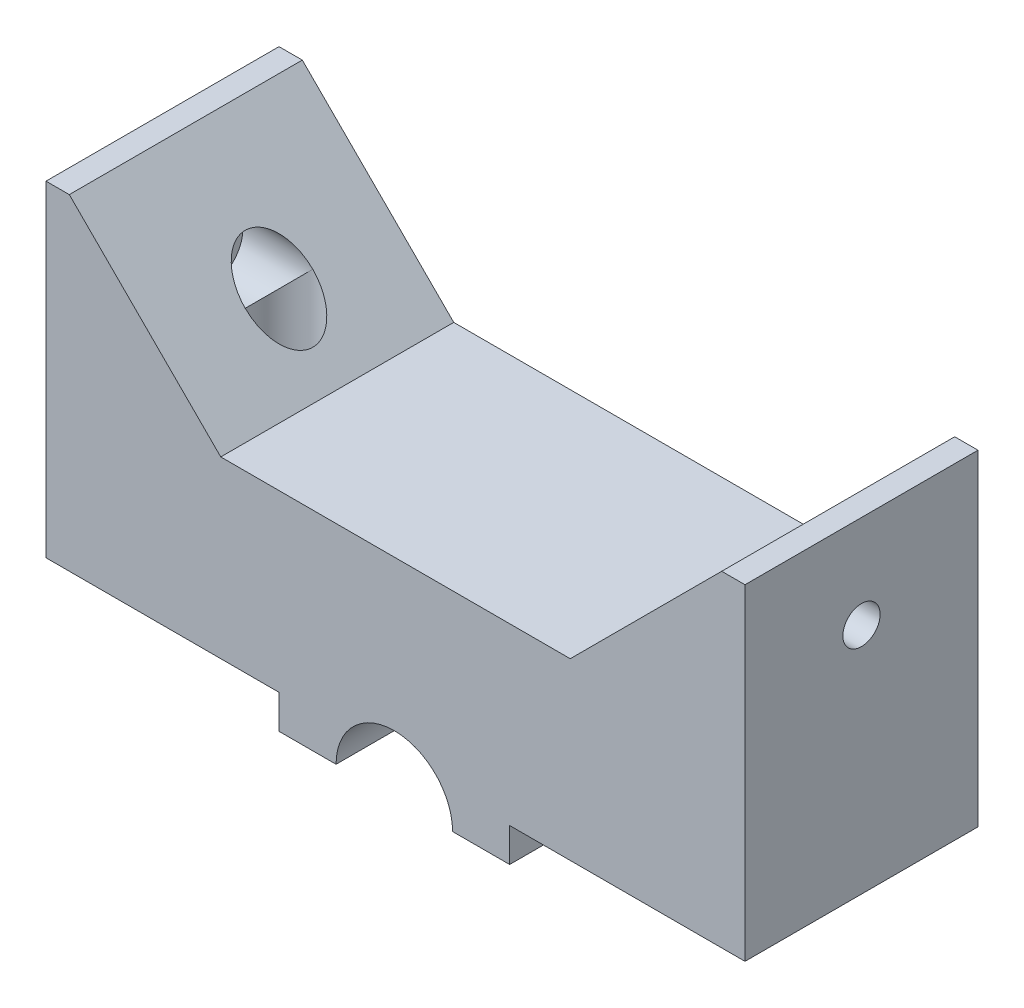
ISO-10303-21;
HEADER;
FILE_DESCRIPTION(('STEP AP214'),'2;1');
FILE_NAME('part.step','',(''),(''),'','','');
FILE_SCHEMA(('AUTOMOTIVE_DESIGN { 1 0 10303 214 1 1 1 1 }'));
ENDSEC;
DATA;
#1=APPLICATION_CONTEXT('core data for automotive mechanical design processes');
#2=APPLICATION_PROTOCOL_DEFINITION('international standard','automotive_design',2000,#1);
#3=PRODUCT_CONTEXT('',#1,'mechanical');
#4=PRODUCT('Part','Part','',(#3));
#5=PRODUCT_RELATED_PRODUCT_CATEGORY('part','',(#4));
#6=PRODUCT_DEFINITION_FORMATION('','',#4);
#7=PRODUCT_DEFINITION_CONTEXT('part definition',#1,'design');
#8=PRODUCT_DEFINITION('design','',#6,#7);
#9=PRODUCT_DEFINITION_SHAPE('','',#8);
#10=(LENGTH_UNIT() NAMED_UNIT(*) SI_UNIT(.MILLI.,.METRE.));
#11=(NAMED_UNIT(*) PLANE_ANGLE_UNIT() SI_UNIT($,.RADIAN.));
#12=(NAMED_UNIT(*) SI_UNIT($,.STERADIAN.) SOLID_ANGLE_UNIT());
#13=UNCERTAINTY_MEASURE_WITH_UNIT(LENGTH_MEASURE(1.E-05),#10,'distance_accuracy_value','');
#14=(GEOMETRIC_REPRESENTATION_CONTEXT(3) GLOBAL_UNCERTAINTY_ASSIGNED_CONTEXT((#13)) GLOBAL_UNIT_ASSIGNED_CONTEXT((#10,
#11,#12)) REPRESENTATION_CONTEXT('',''));
#15=CARTESIAN_POINT('',(0.,0.,0.));
#16=DIRECTION('',(0.,0.,1.));
#17=DIRECTION('',(1.,0.,0.));
#18=AXIS2_PLACEMENT_3D('',#15,#16,#17);
#19=CARTESIAN_POINT('',(4.,20.,10.));
#20=DIRECTION('',(1.,0.,0.));
#21=DIRECTION('',(0.,0.,-1.));
#22=AXIS2_PLACEMENT_3D('',#19,#20,#21);
#23=CYLINDRICAL_SURFACE('',#22,2.9);
#24=CARTESIAN_POINT('',(56.,20.,10.));
#25=DIRECTION('',(-1.,0.,0.));
#26=DIRECTION('',(0.,0.,1.));
#27=AXIS2_PLACEMENT_3D('',#24,#25,#26);
#28=CIRCLE('',#27,2.9);
#29=CARTESIAN_POINT('',(56.,20.,12.9));
#30=VERTEX_POINT('',#29);
#31=EDGE_CURVE('E284',#30,#30,#28,.T.);
#32=ORIENTED_EDGE('',*,*,#31,.F.);
#33=EDGE_LOOP('',(#32));
#34=FACE_BOUND('',#33,.T.);
#35=CARTESIAN_POINT('',(50.,20.,10.));
#36=DIRECTION('',(-0.707106781186548,0.707106781186548,0.));
#37=DIRECTION('',(0.707106781186548,0.707106781186548,0.));
#38=AXIS2_PLACEMENT_3D('',#35,#36,#37);
#39=ELLIPSE('',#38,4.10121933088198,2.9);
#40=CARTESIAN_POINT('',(49.95,19.95,7.1004310665204));
#41=VERTEX_POINT('',#40);
#42=CARTESIAN_POINT('',(49.95,19.95,12.8995689334796));
#43=VERTEX_POINT('',#42);
#44=EDGE_CURVE('E161',#41,#43,#39,.F.);
#45=ORIENTED_EDGE('',*,*,#44,.F.);
#46=CARTESIAN_POINT('',(49.9,20.,10.));
#47=DIRECTION('',(0.707106781186547,0.707106781186548,0.));
#48=DIRECTION('',(0.707106781186547,-0.707106781186548,0.));
#49=AXIS2_PLACEMENT_3D('',#46,#47,#48);
#50=ELLIPSE('',#49,4.10121933088198,2.9);
#51=EDGE_CURVE('E11',#41,#43,#50,.F.);
#52=ORIENTED_EDGE('',*,*,#51,.T.);
#53=EDGE_LOOP('',(#45,#52));
#54=FACE_BOUND('',#53,.T.);
#55=ADVANCED_FACE('F41',(#34,#54),#23,.F.);
#56=CARTESIAN_POINT('',(4.,20.,10.));
#57=DIRECTION('',(-1.,0.,0.));
#58=DIRECTION('',(0.,0.,1.));
#59=AXIS2_PLACEMENT_3D('',#56,#57,#58);
#60=CIRCLE('',#59,2.9);
#61=CARTESIAN_POINT('',(4.,20.,12.9));
#62=VERTEX_POINT('',#61);
#63=EDGE_CURVE('E155',#62,#62,#60,.T.);
#64=ORIENTED_EDGE('',*,*,#63,.T.);
#65=EDGE_LOOP('',(#64));
#66=FACE_BOUND('',#65,.T.);
#67=CARTESIAN_POINT('',(10.,20.,10.));
#68=DIRECTION('',(0.707106781186548,0.707106781186548,0.));
#69=DIRECTION('',(0.707106781186548,-0.707106781186548,0.));
#70=AXIS2_PLACEMENT_3D('',#67,#68,#69);
#71=ELLIPSE('',#70,4.10121933088198,2.9);
#72=CARTESIAN_POINT('',(10.,20.,12.9));
#73=VERTEX_POINT('',#72);
#74=CARTESIAN_POINT('',(10.,20.,7.1));
#75=VERTEX_POINT('',#74);
#76=EDGE_CURVE('E154',#73,#75,#71,.F.);
#77=ORIENTED_EDGE('',*,*,#76,.F.);
#78=CARTESIAN_POINT('',(10.,20.,10.));
#79=DIRECTION('',(0.707106781186547,-0.707106781186548,0.));
#80=DIRECTION('',(0.707106781186547,0.707106781186548,0.));
#81=AXIS2_PLACEMENT_3D('',#78,#79,#80);
#82=ELLIPSE('',#81,4.10121933088198,2.9);
#83=EDGE_CURVE('E49',#73,#75,#82,.T.);
#84=ORIENTED_EDGE('',*,*,#83,.T.);
#85=EDGE_LOOP('',(#77,#84));
#86=FACE_BOUND('',#85,.T.);
#87=ADVANCED_FACE('F158',(#66,#86),#23,.F.);
#88=CARTESIAN_POINT('',(10.,25.,10.));
#89=DIRECTION('',(0.,-1.,0.));
#90=DIRECTION('',(0.,0.,-1.));
#91=AXIS2_PLACEMENT_3D('',#88,#89,#90);
#92=CYLINDRICAL_SURFACE('',#91,1.6);
#93=CARTESIAN_POINT('',(10.,0.,10.));
#94=DIRECTION('',(0.,-1.,0.));
#95=DIRECTION('',(0.,0.,-1.));
#96=AXIS2_PLACEMENT_3D('',#93,#94,#95);
#97=CIRCLE('',#96,1.6);
#98=CARTESIAN_POINT('',(10.,0.,8.4));
#99=VERTEX_POINT('',#98);
#100=EDGE_CURVE('E290',#99,#99,#97,.T.);
#101=ORIENTED_EDGE('',*,*,#100,.T.);
#102=EDGE_LOOP('',(#101));
#103=FACE_BOUND('',#102,.T.);
#104=CARTESIAN_POINT('',(10.,5.,10.));
#105=DIRECTION('',(0.,1.,0.));
#106=DIRECTION('',(0.,0.,1.));
#107=AXIS2_PLACEMENT_3D('',#104,#105,#106);
#108=CIRCLE('',#107,1.6);
#109=CARTESIAN_POINT('',(10.,5.,11.6));
#110=VERTEX_POINT('',#109);
#111=EDGE_CURVE('E302',#110,#110,#108,.T.);
#112=ORIENTED_EDGE('',*,*,#111,.T.);
#113=EDGE_LOOP('',(#112));
#114=FACE_BOUND('',#113,.T.);
#115=ADVANCED_FACE('F337',(#103,#114),#92,.F.);
#116=CARTESIAN_POINT('',(49.9,25.,10.));
#117=DIRECTION('',(0.,-1.,0.));
#118=DIRECTION('',(0.,0.,-1.));
#119=AXIS2_PLACEMENT_3D('',#116,#117,#118);
#120=CYLINDRICAL_SURFACE('',#119,1.6);
#121=CARTESIAN_POINT('',(49.9,0.,10.));
#122=DIRECTION('',(0.,-1.,0.));
#123=DIRECTION('',(0.,0.,-1.));
#124=AXIS2_PLACEMENT_3D('',#121,#122,#123);
#125=CIRCLE('',#124,1.6);
#126=CARTESIAN_POINT('',(49.9,0.,8.4));
#127=VERTEX_POINT('',#126);
#128=EDGE_CURVE('E291',#127,#127,#125,.T.);
#129=ORIENTED_EDGE('',*,*,#128,.T.);
#130=EDGE_LOOP('',(#129));
#131=FACE_BOUND('',#130,.T.);
#132=CARTESIAN_POINT('',(49.9,5.,10.));
#133=DIRECTION('',(0.,1.,0.));
#134=DIRECTION('',(0.,0.,1.));
#135=AXIS2_PLACEMENT_3D('',#132,#133,#134);
#136=CIRCLE('',#135,1.6);
#137=CARTESIAN_POINT('',(49.9,5.,11.6));
#138=VERTEX_POINT('',#137);
#139=EDGE_CURVE('E301',#138,#138,#136,.T.);
#140=ORIENTED_EDGE('',*,*,#139,.T.);
#141=EDGE_LOOP('',(#140));
#142=FACE_BOUND('',#141,.T.);
#143=ADVANCED_FACE('F310',(#131,#142),#120,.F.);
#144=CARTESIAN_POINT('',(15.,-15.,5.));
#145=DIRECTION('',(-0.707106781186548,0.707106781186548,0.));
#146=DIRECTION('',(-0.707106781186548,-0.707106781186548,0.));
#147=AXIS2_PLACEMENT_3D('',#144,#145,#146);
#148=PLANE('',#147);
#149=DIRECTION('',(0.707106781186548,0.707106781186548,0.));
#150=VECTOR('',#149,1.);
#151=CARTESIAN_POINT('',(15.,-15.,0.));
#152=LINE('',#151,#150);
#153=CARTESIAN_POINT('',(45.,15.,0.));
#154=VERTEX_POINT('',#153);
#155=CARTESIAN_POINT('',(58.,28.,0.));
#156=VERTEX_POINT('',#155);
#157=EDGE_CURVE('E200',#154,#156,#152,.T.);
#158=ORIENTED_EDGE('',*,*,#157,.F.);
#159=DIRECTION('',(0.,0.,-1.));
#160=VECTOR('',#159,1.);
#161=CARTESIAN_POINT('',(45.,15.,5.));
#162=LINE('',#161,#160);
#163=CARTESIAN_POINT('',(45.,15.,20.));
#164=VERTEX_POINT('',#163);
#165=EDGE_CURVE('E187',#164,#154,#162,.T.);
#166=ORIENTED_EDGE('',*,*,#165,.F.);
#167=DIRECTION('',(-0.707106781186548,-0.707106781186548,0.));
#168=VECTOR('',#167,1.);
#169=CARTESIAN_POINT('',(15.,-15.,20.));
#170=LINE('',#169,#168);
#171=CARTESIAN_POINT('',(58.,28.,20.));
#172=VERTEX_POINT('',#171);
#173=EDGE_CURVE('E255',#172,#164,#170,.T.);
#174=ORIENTED_EDGE('',*,*,#173,.F.);
#175=DIRECTION('',(0.,0.,-1.));
#176=VECTOR('',#175,1.);
#177=CARTESIAN_POINT('',(58.,28.,5.));
#178=LINE('',#177,#176);
#179=EDGE_CURVE('E185',#172,#156,#178,.T.);
#180=ORIENTED_EDGE('',*,*,#179,.T.);
#181=EDGE_LOOP('',(#158,#166,#174,#180));
#182=FACE_BOUND('',#181,.T.);
#183=ORIENTED_EDGE('',*,*,#44,.T.);
#184=CARTESIAN_POINT('',(49.9,19.9,10.));
#185=DIRECTION('',(-0.707106781186548,0.707106781186548,0.));
#186=DIRECTION('',(-0.707106781186548,-0.707106781186548,0.));
#187=AXIS2_PLACEMENT_3D('',#184,#185,#186);
#188=ELLIPSE('',#187,4.10121933088198,2.9);
#189=EDGE_CURVE('E55',#43,#41,#188,.F.);
#190=ORIENTED_EDGE('',*,*,#189,.T.);
#191=EDGE_LOOP('',(#183,#190));
#192=FACE_BOUND('',#191,.T.);
#193=ADVANCED_FACE('F366',(#182,#192),#148,.T.);
#194=CARTESIAN_POINT('',(15.,15.,5.));
#195=DIRECTION('',(0.707106781186548,0.707106781186548,0.));
#196=DIRECTION('',(-0.707106781186548,0.707106781186548,0.));
#197=AXIS2_PLACEMENT_3D('',#194,#195,#196);
#198=PLANE('',#197);
#199=DIRECTION('',(0.707106781186548,-0.707106781186548,0.));
#200=VECTOR('',#199,1.);
#201=CARTESIAN_POINT('',(15.,15.,0.));
#202=LINE('',#201,#200);
#203=CARTESIAN_POINT('',(2.,28.,0.));
#204=VERTEX_POINT('',#203);
#205=CARTESIAN_POINT('',(15.,15.,0.));
#206=VERTEX_POINT('',#205);
#207=EDGE_CURVE('E194',#204,#206,#202,.T.);
#208=ORIENTED_EDGE('',*,*,#207,.F.);
#209=DIRECTION('',(0.,0.,-1.));
#210=VECTOR('',#209,1.);
#211=CARTESIAN_POINT('',(2.,28.,5.));
#212=LINE('',#211,#210);
#213=CARTESIAN_POINT('',(1.99999999999999,28.,20.));
#214=VERTEX_POINT('',#213);
#215=EDGE_CURVE('E191',#214,#204,#212,.T.);
#216=ORIENTED_EDGE('',*,*,#215,.F.);
#217=DIRECTION('',(-0.707106781186548,0.707106781186548,0.));
#218=VECTOR('',#217,1.);
#219=CARTESIAN_POINT('',(15.,15.,20.));
#220=LINE('',#219,#218);
#221=CARTESIAN_POINT('',(15.,15.,20.));
#222=VERTEX_POINT('',#221);
#223=EDGE_CURVE('E249',#222,#214,#220,.T.);
#224=ORIENTED_EDGE('',*,*,#223,.F.);
#225=DIRECTION('',(0.,0.,-1.));
#226=VECTOR('',#225,1.);
#227=CARTESIAN_POINT('',(15.,15.,5.));
#228=LINE('',#227,#226);
#229=EDGE_CURVE('E189',#222,#206,#228,.T.);
#230=ORIENTED_EDGE('',*,*,#229,.T.);
#231=EDGE_LOOP('',(#208,#216,#224,#230));
#232=FACE_BOUND('',#231,.T.);
#233=ORIENTED_EDGE('',*,*,#76,.T.);
#234=EDGE_CURVE('E149',#75,#73,#71,.F.);
#235=ORIENTED_EDGE('',*,*,#234,.T.);
#236=EDGE_LOOP('',(#233,#235));
#237=FACE_BOUND('',#236,.T.);
#238=ADVANCED_FACE('F160',(#232,#237),#198,.T.);
#239=CARTESIAN_POINT('',(0.,20.,10.));
#240=DIRECTION('',(1.,0.,0.));
#241=DIRECTION('',(0.,0.,-1.));
#242=AXIS2_PLACEMENT_3D('',#239,#240,#241);
#243=CYLINDRICAL_SURFACE('',#242,1.6);
#244=CARTESIAN_POINT('',(60.,20.,10.));
#245=DIRECTION('',(1.,0.,0.));
#246=DIRECTION('',(0.,0.,-1.));
#247=AXIS2_PLACEMENT_3D('',#244,#245,#246);
#248=CIRCLE('',#247,1.6);
#249=CARTESIAN_POINT('',(60.,20.,8.4));
#250=VERTEX_POINT('',#249);
#251=EDGE_CURVE('E163',#250,#250,#248,.T.);
#252=ORIENTED_EDGE('',*,*,#251,.T.);
#253=EDGE_LOOP('',(#252));
#254=FACE_BOUND('',#253,.T.);
#255=CARTESIAN_POINT('',(56.,20.,10.));
#256=DIRECTION('',(-1.,0.,0.));
#257=DIRECTION('',(0.,0.,1.));
#258=AXIS2_PLACEMENT_3D('',#255,#256,#257);
#259=CIRCLE('',#258,1.6);
#260=CARTESIAN_POINT('',(56.,20.,11.6));
#261=VERTEX_POINT('',#260);
#262=EDGE_CURVE('E287',#261,#261,#259,.T.);
#263=ORIENTED_EDGE('',*,*,#262,.T.);
#264=EDGE_LOOP('',(#263));
#265=FACE_BOUND('',#264,.T.);
#266=ADVANCED_FACE('F348',(#254,#265),#243,.F.);
#267=CARTESIAN_POINT('',(0.,0.,5.));
#268=DIRECTION('',(0.,0.,1.));
#269=DIRECTION('',(1.,0.,0.));
#270=AXIS2_PLACEMENT_3D('',#267,#268,#269);
#271=PLANE('',#270);
#272=DIRECTION('',(1.,0.,0.));
#273=VECTOR('',#272,1.);
#274=CARTESIAN_POINT('',(0.,-2.9,5.));
#275=LINE('',#274,#273);
#276=CARTESIAN_POINT('',(24.9,-2.9,5.));
#277=VERTEX_POINT('',#276);
#278=CARTESIAN_POINT('',(34.9,-2.9,5.));
#279=VERTEX_POINT('',#278);
#280=EDGE_CURVE('E193',#277,#279,#275,.T.);
#281=ORIENTED_EDGE('',*,*,#280,.T.);
#282=CARTESIAN_POINT('',(29.9,-2.9,5.));
#283=DIRECTION('',(0.,0.,1.));
#284=DIRECTION('',(1.,0.,0.));
#285=AXIS2_PLACEMENT_3D('',#282,#283,#284);
#286=CIRCLE('',#285,5.);
#287=EDGE_CURVE('E232',#279,#277,#286,.T.);
#288=ORIENTED_EDGE('',*,*,#287,.T.);
#289=EDGE_LOOP('',(#281,#288));
#290=FACE_BOUND('',#289,.T.);
#291=ADVANCED_FACE('F357',(#290),#271,.T.);
#292=CARTESIAN_POINT('',(0.,28.,5.));
#293=DIRECTION('',(0.,1.,0.));
#294=DIRECTION('',(0.,0.,1.));
#295=AXIS2_PLACEMENT_3D('',#292,#293,#294);
#296=PLANE('',#295);
#297=DIRECTION('',(1.,0.,0.));
#298=VECTOR('',#297,1.);
#299=CARTESIAN_POINT('',(0.,28.,0.));
#300=LINE('',#299,#298);
#301=CARTESIAN_POINT('',(0.,28.,0.));
#302=VERTEX_POINT('',#301);
#303=EDGE_CURVE('E222',#302,#204,#300,.T.);
#304=ORIENTED_EDGE('',*,*,#303,.F.);
#305=DIRECTION('',(0.,0.,-1.));
#306=VECTOR('',#305,1.);
#307=CARTESIAN_POINT('',(0.,28.,5.));
#308=LINE('',#307,#306);
#309=CARTESIAN_POINT('',(0.,28.,20.));
#310=VERTEX_POINT('',#309);
#311=EDGE_CURVE('E159',#310,#302,#308,.T.);
#312=ORIENTED_EDGE('',*,*,#311,.F.);
#313=DIRECTION('',(-1.,0.,0.));
#314=VECTOR('',#313,1.);
#315=CARTESIAN_POINT('',(0.,28.,20.));
#316=LINE('',#315,#314);
#317=EDGE_CURVE('E246',#214,#310,#316,.T.);
#318=ORIENTED_EDGE('',*,*,#317,.F.);
#319=ORIENTED_EDGE('',*,*,#215,.T.);
#320=EDGE_LOOP('',(#304,#312,#318,#319));
#321=FACE_BOUND('',#320,.T.);
#322=ADVANCED_FACE('F43',(#321),#296,.T.);
#323=CARTESIAN_POINT('',(0.,0.,5.));
#324=DIRECTION('',(-1.,0.,0.));
#325=DIRECTION('',(0.,0.,1.));
#326=AXIS2_PLACEMENT_3D('',#323,#324,#325);
#327=PLANE('',#326);
#328=CARTESIAN_POINT('',(0.,20.,10.));
#329=DIRECTION('',(1.,0.,0.));
#330=DIRECTION('',(0.,0.,-1.));
#331=AXIS2_PLACEMENT_3D('',#328,#329,#330);
#332=CIRCLE('',#331,1.6);
#333=CARTESIAN_POINT('',(0.,20.,8.4));
#334=VERTEX_POINT('',#333);
#335=EDGE_CURVE('E236',#334,#334,#332,.T.);
#336=ORIENTED_EDGE('',*,*,#335,.T.);
#337=EDGE_LOOP('',(#336));
#338=FACE_BOUND('',#337,.T.);
#339=DIRECTION('',(0.,1.,0.));
#340=VECTOR('',#339,1.);
#341=CARTESIAN_POINT('',(0.,0.,0.));
#342=LINE('',#341,#340);
#343=CARTESIAN_POINT('',(0.,0.,0.));
#344=VERTEX_POINT('',#343);
#345=EDGE_CURVE('E219',#344,#302,#342,.T.);
#346=ORIENTED_EDGE('',*,*,#345,.F.);
#347=DIRECTION('',(0.,0.,-1.));
#348=VECTOR('',#347,1.);
#349=CARTESIAN_POINT('',(0.,0.,5.));
#350=LINE('',#349,#348);
#351=CARTESIAN_POINT('',(0.,0.,20.));
#352=VERTEX_POINT('',#351);
#353=EDGE_CURVE('E167',#352,#344,#350,.T.);
#354=ORIENTED_EDGE('',*,*,#353,.F.);
#355=DIRECTION('',(0.,-1.,0.));
#356=VECTOR('',#355,1.);
#357=CARTESIAN_POINT('',(0.,0.,20.));
#358=LINE('',#357,#356);
#359=EDGE_CURVE('E243',#310,#352,#358,.T.);
#360=ORIENTED_EDGE('',*,*,#359,.F.);
#361=ORIENTED_EDGE('',*,*,#311,.T.);
#362=EDGE_LOOP('',(#346,#354,#360,#361));
#363=FACE_BOUND('',#362,.T.);
#364=ADVANCED_FACE('F397',(#338,#363),#327,.T.);
#365=CARTESIAN_POINT('',(0.,0.,5.));
#366=DIRECTION('',(0.,1.,0.));
#367=DIRECTION('',(0.,0.,1.));
#368=AXIS2_PLACEMENT_3D('',#365,#366,#367);
#369=PLANE('',#368);
#370=ORIENTED_EDGE('',*,*,#100,.F.);
#371=EDGE_LOOP('',(#370));
#372=FACE_BOUND('',#371,.T.);
#373=DIRECTION('',(1.,0.,0.));
#374=VECTOR('',#373,1.);
#375=CARTESIAN_POINT('',(0.,0.,0.));
#376=LINE('',#375,#374);
#377=CARTESIAN_POINT('',(20.,0.,0.));
#378=VERTEX_POINT('',#377);
#379=EDGE_CURVE('E217',#344,#378,#376,.T.);
#380=ORIENTED_EDGE('',*,*,#379,.T.);
#381=DIRECTION('',(0.,0.,-1.));
#382=VECTOR('',#381,1.);
#383=CARTESIAN_POINT('',(20.,0.,5.));
#384=LINE('',#383,#382);
#385=CARTESIAN_POINT('',(20.,0.,20.));
#386=VERTEX_POINT('',#385);
#387=EDGE_CURVE('E169',#386,#378,#384,.T.);
#388=ORIENTED_EDGE('',*,*,#387,.F.);
#389=DIRECTION('',(1.,0.,0.));
#390=VECTOR('',#389,1.);
#391=CARTESIAN_POINT('',(0.,0.,20.));
#392=LINE('',#391,#390);
#393=EDGE_CURVE('E240',#352,#386,#392,.T.);
#394=ORIENTED_EDGE('',*,*,#393,.F.);
#395=ORIENTED_EDGE('',*,*,#353,.T.);
#396=EDGE_LOOP('',(#380,#388,#394,#395));
#397=FACE_BOUND('',#396,.T.);
#398=ADVANCED_FACE('F386',(#372,#397),#369,.F.);
#399=CARTESIAN_POINT('',(20.,0.,5.));
#400=DIRECTION('',(1.,0.,0.));
#401=DIRECTION('',(0.,0.,-1.));
#402=AXIS2_PLACEMENT_3D('',#399,#400,#401);
#403=PLANE('',#402);
#404=DIRECTION('',(0.,-1.,0.));
#405=VECTOR('',#404,1.);
#406=CARTESIAN_POINT('',(20.,0.,0.));
#407=LINE('',#406,#405);
#408=CARTESIAN_POINT('',(20.,-2.9,0.));
#409=VERTEX_POINT('',#408);
#410=EDGE_CURVE('E215',#378,#409,#407,.T.);
#411=ORIENTED_EDGE('',*,*,#410,.T.);
#412=DIRECTION('',(0.,0.,-1.));
#413=VECTOR('',#412,1.);
#414=CARTESIAN_POINT('',(20.,-2.9,5.));
#415=LINE('',#414,#413);
#416=CARTESIAN_POINT('',(20.,-2.9,20.));
#417=VERTEX_POINT('',#416);
#418=EDGE_CURVE('E172',#417,#409,#415,.T.);
#419=ORIENTED_EDGE('',*,*,#418,.F.);
#420=DIRECTION('',(0.,-1.,0.));
#421=VECTOR('',#420,1.);
#422=CARTESIAN_POINT('',(20.,0.,20.));
#423=LINE('',#422,#421);
#424=EDGE_CURVE('E237',#386,#417,#423,.T.);
#425=ORIENTED_EDGE('',*,*,#424,.F.);
#426=ORIENTED_EDGE('',*,*,#387,.T.);
#427=EDGE_LOOP('',(#411,#419,#425,#426));
#428=FACE_BOUND('',#427,.T.);
#429=ADVANCED_FACE('F393',(#428),#403,.F.);
#430=CARTESIAN_POINT('',(0.,-2.9,5.));
#431=DIRECTION('',(0.,1.,0.));
#432=DIRECTION('',(0.,0.,1.));
#433=AXIS2_PLACEMENT_3D('',#430,#431,#432);
#434=PLANE('',#433);
#435=DIRECTION('',(1.,0.,0.));
#436=VECTOR('',#435,1.);
#437=CARTESIAN_POINT('',(0.,-2.9,0.));
#438=LINE('',#437,#436);
#439=CARTESIAN_POINT('',(39.8,-2.9,0.));
#440=VERTEX_POINT('',#439);
#441=EDGE_CURVE('E212',#409,#440,#438,.T.);
#442=ORIENTED_EDGE('',*,*,#441,.T.);
#443=DIRECTION('',(0.,0.,-1.));
#444=VECTOR('',#443,1.);
#445=CARTESIAN_POINT('',(39.8,-2.9,5.));
#446=LINE('',#445,#444);
#447=CARTESIAN_POINT('',(39.8,-2.9,20.));
#448=VERTEX_POINT('',#447);
#449=EDGE_CURVE('E175',#448,#440,#446,.T.);
#450=ORIENTED_EDGE('',*,*,#449,.F.);
#451=DIRECTION('',(1.,0.,0.));
#452=VECTOR('',#451,1.);
#453=CARTESIAN_POINT('',(0.,-2.9,20.));
#454=LINE('',#453,#452);
#455=CARTESIAN_POINT('',(34.9,-2.9,20.));
#456=VERTEX_POINT('',#455);
#457=EDGE_CURVE('E270',#456,#448,#454,.T.);
#458=ORIENTED_EDGE('',*,*,#457,.F.);
#459=DIRECTION('',(0.,0.,-1.));
#460=VECTOR('',#459,1.);
#461=CARTESIAN_POINT('',(34.9,-2.9,20.));
#462=LINE('',#461,#460);
#463=EDGE_CURVE('E225',#456,#279,#462,.T.);
#464=ORIENTED_EDGE('',*,*,#463,.T.);
#465=ORIENTED_EDGE('',*,*,#280,.F.);
#466=DIRECTION('',(0.,0.,-1.));
#467=VECTOR('',#466,1.);
#468=CARTESIAN_POINT('',(24.9,-2.9,20.));
#469=LINE('',#468,#467);
#470=CARTESIAN_POINT('',(24.9,-2.9,20.));
#471=VERTEX_POINT('',#470);
#472=EDGE_CURVE('E229',#471,#277,#469,.T.);
#473=ORIENTED_EDGE('',*,*,#472,.F.);
#474=EDGE_CURVE('E231',#417,#471,#454,.T.);
#475=ORIENTED_EDGE('',*,*,#474,.F.);
#476=ORIENTED_EDGE('',*,*,#418,.T.);
#477=EDGE_LOOP('',(#442,#450,#458,#464,#465,#473,#475,#476));
#478=FACE_BOUND('',#477,.T.);
#479=ADVANCED_FACE('F389',(#478),#434,.F.);
#480=CARTESIAN_POINT('',(39.8,0.,5.));
#481=DIRECTION('',(1.,0.,0.));
#482=DIRECTION('',(0.,0.,-1.));
#483=AXIS2_PLACEMENT_3D('',#480,#481,#482);
#484=PLANE('',#483);
#485=DIRECTION('',(0.,-1.,0.));
#486=VECTOR('',#485,1.);
#487=CARTESIAN_POINT('',(39.8,0.,0.));
#488=LINE('',#487,#486);
#489=CARTESIAN_POINT('',(39.8,0.,0.));
#490=VERTEX_POINT('',#489);
#491=EDGE_CURVE('E209',#490,#440,#488,.T.);
#492=ORIENTED_EDGE('',*,*,#491,.F.);
#493=DIRECTION('',(0.,0.,-1.));
#494=VECTOR('',#493,1.);
#495=CARTESIAN_POINT('',(39.8,0.,5.));
#496=LINE('',#495,#494);
#497=CARTESIAN_POINT('',(39.8,0.,20.));
#498=VERTEX_POINT('',#497);
#499=EDGE_CURVE('E177',#498,#490,#496,.T.);
#500=ORIENTED_EDGE('',*,*,#499,.F.);
#501=DIRECTION('',(0.,1.,0.));
#502=VECTOR('',#501,1.);
#503=CARTESIAN_POINT('',(39.8,0.,20.));
#504=LINE('',#503,#502);
#505=EDGE_CURVE('E267',#448,#498,#504,.T.);
#506=ORIENTED_EDGE('',*,*,#505,.F.);
#507=ORIENTED_EDGE('',*,*,#449,.T.);
#508=EDGE_LOOP('',(#492,#500,#506,#507));
#509=FACE_BOUND('',#508,.T.);
#510=ADVANCED_FACE('F384',(#509),#484,.T.);
#511=ORIENTED_EDGE('',*,*,#128,.F.);
#512=EDGE_LOOP('',(#511));
#513=FACE_BOUND('',#512,.T.);
#514=CARTESIAN_POINT('',(60.,0.,0.));
#515=VERTEX_POINT('',#514);
#516=EDGE_CURVE('E208',#490,#515,#376,.T.);
#517=ORIENTED_EDGE('',*,*,#516,.T.);
#518=DIRECTION('',(0.,0.,-1.));
#519=VECTOR('',#518,1.);
#520=CARTESIAN_POINT('',(60.,0.,5.));
#521=LINE('',#520,#519);
#522=CARTESIAN_POINT('',(60.,0.,20.));
#523=VERTEX_POINT('',#522);
#524=EDGE_CURVE('E179',#523,#515,#521,.T.);
#525=ORIENTED_EDGE('',*,*,#524,.F.);
#526=DIRECTION('',(1.,0.,0.));
#527=VECTOR('',#526,1.);
#528=CARTESIAN_POINT('',(0.,0.,20.));
#529=LINE('',#528,#527);
#530=EDGE_CURVE('E264',#498,#523,#529,.T.);
#531=ORIENTED_EDGE('',*,*,#530,.F.);
#532=ORIENTED_EDGE('',*,*,#499,.T.);
#533=EDGE_LOOP('',(#517,#525,#531,#532));
#534=FACE_BOUND('',#533,.T.);
#535=ADVANCED_FACE('F381',(#513,#534),#369,.F.);
#536=CARTESIAN_POINT('',(60.,0.,5.));
#537=DIRECTION('',(-1.,0.,0.));
#538=DIRECTION('',(0.,0.,1.));
#539=AXIS2_PLACEMENT_3D('',#536,#537,#538);
#540=PLANE('',#539);
#541=ORIENTED_EDGE('',*,*,#251,.F.);
#542=EDGE_LOOP('',(#541));
#543=FACE_BOUND('',#542,.T.);
#544=DIRECTION('',(0.,1.,0.));
#545=VECTOR('',#544,1.);
#546=CARTESIAN_POINT('',(60.,0.,0.));
#547=LINE('',#546,#545);
#548=CARTESIAN_POINT('',(60.,28.,0.));
#549=VERTEX_POINT('',#548);
#550=EDGE_CURVE('E206',#515,#549,#547,.T.);
#551=ORIENTED_EDGE('',*,*,#550,.T.);
#552=DIRECTION('',(0.,0.,-1.));
#553=VECTOR('',#552,1.);
#554=CARTESIAN_POINT('',(60.,28.,5.));
#555=LINE('',#554,#553);
#556=CARTESIAN_POINT('',(60.,28.,20.));
#557=VERTEX_POINT('',#556);
#558=EDGE_CURVE('E182',#557,#549,#555,.T.);
#559=ORIENTED_EDGE('',*,*,#558,.F.);
#560=DIRECTION('',(0.,1.,0.));
#561=VECTOR('',#560,1.);
#562=CARTESIAN_POINT('',(60.,0.,20.));
#563=LINE('',#562,#561);
#564=EDGE_CURVE('E261',#523,#557,#563,.T.);
#565=ORIENTED_EDGE('',*,*,#564,.F.);
#566=ORIENTED_EDGE('',*,*,#524,.T.);
#567=EDGE_LOOP('',(#551,#559,#565,#566));
#568=FACE_BOUND('',#567,.T.);
#569=ADVANCED_FACE('F377',(#543,#568),#540,.F.);
#570=CARTESIAN_POINT('',(0.,28.,5.));
#571=DIRECTION('',(0.,-1.,0.));
#572=DIRECTION('',(0.,0.,-1.));
#573=AXIS2_PLACEMENT_3D('',#570,#571,#572);
#574=PLANE('',#573);
#575=DIRECTION('',(-1.,0.,0.));
#576=VECTOR('',#575,1.);
#577=CARTESIAN_POINT('',(0.,28.,0.));
#578=LINE('',#577,#576);
#579=EDGE_CURVE('E203',#549,#156,#578,.T.);
#580=ORIENTED_EDGE('',*,*,#579,.T.);
#581=ORIENTED_EDGE('',*,*,#179,.F.);
#582=DIRECTION('',(-1.,0.,0.));
#583=VECTOR('',#582,1.);
#584=CARTESIAN_POINT('',(0.,28.,20.));
#585=LINE('',#584,#583);
#586=EDGE_CURVE('E258',#557,#172,#585,.T.);
#587=ORIENTED_EDGE('',*,*,#586,.F.);
#588=ORIENTED_EDGE('',*,*,#558,.T.);
#589=EDGE_LOOP('',(#580,#581,#587,#588));
#590=FACE_BOUND('',#589,.T.);
#591=ADVANCED_FACE('F370',(#590),#574,.F.);
#592=CARTESIAN_POINT('',(0.,15.,5.));
#593=DIRECTION('',(0.,1.,0.));
#594=DIRECTION('',(0.,0.,1.));
#595=AXIS2_PLACEMENT_3D('',#592,#593,#594);
#596=PLANE('',#595);
#597=DIRECTION('',(1.,0.,0.));
#598=VECTOR('',#597,1.);
#599=CARTESIAN_POINT('',(0.,15.,0.));
#600=LINE('',#599,#598);
#601=EDGE_CURVE('E197',#206,#154,#600,.T.);
#602=ORIENTED_EDGE('',*,*,#601,.F.);
#603=ORIENTED_EDGE('',*,*,#229,.F.);
#604=DIRECTION('',(-1.,0.,0.));
#605=VECTOR('',#604,1.);
#606=CARTESIAN_POINT('',(0.,15.,20.));
#607=LINE('',#606,#605);
#608=EDGE_CURVE('E252',#164,#222,#607,.T.);
#609=ORIENTED_EDGE('',*,*,#608,.F.);
#610=ORIENTED_EDGE('',*,*,#165,.T.);
#611=EDGE_LOOP('',(#602,#603,#609,#610));
#612=FACE_BOUND('',#611,.T.);
#613=ADVANCED_FACE('F363',(#612),#596,.T.);
#614=CARTESIAN_POINT('',(0.,0.,0.));
#615=DIRECTION('',(0.,0.,1.));
#616=DIRECTION('',(1.,0.,0.));
#617=AXIS2_PLACEMENT_3D('',#614,#615,#616);
#618=PLANE('',#617);
#619=ORIENTED_EDGE('',*,*,#303,.T.);
#620=ORIENTED_EDGE('',*,*,#207,.T.);
#621=ORIENTED_EDGE('',*,*,#601,.T.);
#622=ORIENTED_EDGE('',*,*,#157,.T.);
#623=ORIENTED_EDGE('',*,*,#579,.F.);
#624=ORIENTED_EDGE('',*,*,#550,.F.);
#625=ORIENTED_EDGE('',*,*,#516,.F.);
#626=ORIENTED_EDGE('',*,*,#491,.T.);
#627=ORIENTED_EDGE('',*,*,#441,.F.);
#628=ORIENTED_EDGE('',*,*,#410,.F.);
#629=ORIENTED_EDGE('',*,*,#379,.F.);
#630=ORIENTED_EDGE('',*,*,#345,.T.);
#631=EDGE_LOOP('',(#619,#620,#621,#622,#623,#624,#625,#626,#627,#628,#629,#630));
#632=FACE_BOUND('',#631,.T.);
#633=ADVANCED_FACE('F355',(#632),#618,.F.);
#634=CARTESIAN_POINT('',(29.9,-2.9,20.));
#635=DIRECTION('',(0.,0.,-1.));
#636=DIRECTION('',(-1.,0.,0.));
#637=AXIS2_PLACEMENT_3D('',#634,#635,#636);
#638=CYLINDRICAL_SURFACE('',#637,5.);
#639=ORIENTED_EDGE('',*,*,#287,.F.);
#640=ORIENTED_EDGE('',*,*,#463,.F.);
#641=CARTESIAN_POINT('',(29.9,-2.9,20.));
#642=DIRECTION('',(0.,0.,1.));
#643=DIRECTION('',(1.,0.,0.));
#644=AXIS2_PLACEMENT_3D('',#641,#642,#643);
#645=CIRCLE('',#644,5.);
#646=EDGE_CURVE('E235',#456,#471,#645,.T.);
#647=ORIENTED_EDGE('',*,*,#646,.T.);
#648=ORIENTED_EDGE('',*,*,#472,.T.);
#649=EDGE_LOOP('',(#639,#640,#647,#648));
#650=FACE_BOUND('',#649,.T.);
#651=ADVANCED_FACE('F351',(#650),#638,.F.);
#652=CARTESIAN_POINT('',(0.,0.,20.));
#653=DIRECTION('',(0.,0.,1.));
#654=DIRECTION('',(1.,0.,0.));
#655=AXIS2_PLACEMENT_3D('',#652,#653,#654);
#656=PLANE('',#655);
#657=ORIENTED_EDGE('',*,*,#646,.F.);
#658=ORIENTED_EDGE('',*,*,#457,.T.);
#659=ORIENTED_EDGE('',*,*,#505,.T.);
#660=ORIENTED_EDGE('',*,*,#530,.T.);
#661=ORIENTED_EDGE('',*,*,#564,.T.);
#662=ORIENTED_EDGE('',*,*,#586,.T.);
#663=ORIENTED_EDGE('',*,*,#173,.T.);
#664=ORIENTED_EDGE('',*,*,#608,.T.);
#665=ORIENTED_EDGE('',*,*,#223,.T.);
#666=ORIENTED_EDGE('',*,*,#317,.T.);
#667=ORIENTED_EDGE('',*,*,#359,.T.);
#668=ORIENTED_EDGE('',*,*,#393,.T.);
#669=ORIENTED_EDGE('',*,*,#424,.T.);
#670=ORIENTED_EDGE('',*,*,#474,.T.);
#671=EDGE_LOOP('',(#657,#658,#659,#660,#661,#662,#663,#664,#665,#666,#667,#668,#669,#670));
#672=FACE_BOUND('',#671,.T.);
#673=ADVANCED_FACE('F346',(#672),#656,.T.);
#674=CARTESIAN_POINT('',(4.,20.,10.));
#675=DIRECTION('',(-1.,0.,0.));
#676=DIRECTION('',(0.,0.,1.));
#677=AXIS2_PLACEMENT_3D('',#674,#675,#676);
#678=CIRCLE('',#677,1.6);
#679=CARTESIAN_POINT('',(4.,20.,11.6));
#680=VERTEX_POINT('',#679);
#681=EDGE_CURVE('E281',#680,#680,#678,.T.);
#682=ORIENTED_EDGE('',*,*,#681,.F.);
#683=EDGE_LOOP('',(#682));
#684=FACE_BOUND('',#683,.T.);
#685=ORIENTED_EDGE('',*,*,#335,.F.);
#686=EDGE_LOOP('',(#685));
#687=FACE_BOUND('',#686,.T.);
#688=ADVANCED_FACE('F343',(#684,#687),#243,.F.);
#689=CARTESIAN_POINT('',(56.,20.,10.));
#690=DIRECTION('',(-1.,0.,0.));
#691=DIRECTION('',(0.,0.,1.));
#692=AXIS2_PLACEMENT_3D('',#689,#690,#691);
#693=PLANE('',#692);
#694=ORIENTED_EDGE('',*,*,#262,.F.);
#695=EDGE_LOOP('',(#694));
#696=FACE_BOUND('',#695,.T.);
#697=ORIENTED_EDGE('',*,*,#31,.T.);
#698=EDGE_LOOP('',(#697));
#699=FACE_BOUND('',#698,.T.);
#700=ADVANCED_FACE('F326',(#696,#699),#693,.T.);
#701=CARTESIAN_POINT('',(4.,20.,10.));
#702=DIRECTION('',(-1.,0.,0.));
#703=DIRECTION('',(0.,0.,1.));
#704=AXIS2_PLACEMENT_3D('',#701,#702,#703);
#705=PLANE('',#704);
#706=ORIENTED_EDGE('',*,*,#63,.F.);
#707=EDGE_LOOP('',(#706));
#708=FACE_BOUND('',#707,.T.);
#709=ORIENTED_EDGE('',*,*,#681,.T.);
#710=EDGE_LOOP('',(#709));
#711=FACE_BOUND('',#710,.T.);
#712=ADVANCED_FACE('F320',(#708,#711),#705,.F.);
#713=CARTESIAN_POINT('',(49.9,40.,10.));
#714=DIRECTION('',(0.,-1.,0.));
#715=DIRECTION('',(0.,0.,-1.));
#716=AXIS2_PLACEMENT_3D('',#713,#714,#715);
#717=CYLINDRICAL_SURFACE('',#716,2.9);
#718=ORIENTED_EDGE('',*,*,#51,.F.);
#719=ORIENTED_EDGE('',*,*,#189,.F.);
#720=EDGE_LOOP('',(#718,#719));
#721=FACE_BOUND('',#720,.T.);
#722=CARTESIAN_POINT('',(49.9,5.,10.));
#723=DIRECTION('',(0.,1.,0.));
#724=DIRECTION('',(0.,0.,1.));
#725=AXIS2_PLACEMENT_3D('',#722,#723,#724);
#726=CIRCLE('',#725,2.9);
#727=CARTESIAN_POINT('',(49.9,5.,12.9));
#728=VERTEX_POINT('',#727);
#729=EDGE_CURVE('E297',#728,#728,#726,.T.);
#730=ORIENTED_EDGE('',*,*,#729,.F.);
#731=EDGE_LOOP('',(#730));
#732=FACE_BOUND('',#731,.T.);
#733=ADVANCED_FACE('F315',(#721,#732),#717,.F.);
#734=CARTESIAN_POINT('',(49.9,5.,10.));
#735=DIRECTION('',(0.,1.,0.));
#736=DIRECTION('',(0.,0.,1.));
#737=AXIS2_PLACEMENT_3D('',#734,#735,#736);
#738=PLANE('',#737);
#739=ORIENTED_EDGE('',*,*,#139,.F.);
#740=EDGE_LOOP('',(#739));
#741=FACE_BOUND('',#740,.T.);
#742=ORIENTED_EDGE('',*,*,#729,.T.);
#743=EDGE_LOOP('',(#742));
#744=FACE_BOUND('',#743,.T.);
#745=ADVANCED_FACE('F312',(#741,#744),#738,.T.);
#746=CARTESIAN_POINT('',(10.,40.,10.));
#747=DIRECTION('',(0.,-1.,0.));
#748=DIRECTION('',(0.,0.,-1.));
#749=AXIS2_PLACEMENT_3D('',#746,#747,#748);
#750=CYLINDRICAL_SURFACE('',#749,2.9);
#751=CARTESIAN_POINT('',(10.,5.,10.));
#752=DIRECTION('',(0.,1.,0.));
#753=DIRECTION('',(0.,0.,1.));
#754=AXIS2_PLACEMENT_3D('',#751,#752,#753);
#755=CIRCLE('',#754,2.9);
#756=CARTESIAN_POINT('',(10.,5.,12.9));
#757=VERTEX_POINT('',#756);
#758=EDGE_CURVE('E298',#757,#757,#755,.T.);
#759=ORIENTED_EDGE('',*,*,#758,.F.);
#760=EDGE_LOOP('',(#759));
#761=FACE_BOUND('',#760,.T.);
#762=ORIENTED_EDGE('',*,*,#234,.F.);
#763=ORIENTED_EDGE('',*,*,#83,.F.);
#764=EDGE_LOOP('',(#762,#763));
#765=FACE_BOUND('',#764,.T.);
#766=ADVANCED_FACE('F150',(#761,#765),#750,.F.);
#767=CARTESIAN_POINT('',(10.,5.,10.));
#768=DIRECTION('',(0.,1.,0.));
#769=DIRECTION('',(0.,0.,1.));
#770=AXIS2_PLACEMENT_3D('',#767,#768,#769);
#771=PLANE('',#770);
#772=ORIENTED_EDGE('',*,*,#111,.F.);
#773=EDGE_LOOP('',(#772));
#774=FACE_BOUND('',#773,.T.);
#775=ORIENTED_EDGE('',*,*,#758,.T.);
#776=EDGE_LOOP('',(#775));
#777=FACE_BOUND('',#776,.T.);
#778=ADVANCED_FACE('F557',(#774,#777),#771,.T.);
#779=CLOSED_SHELL('',(#55,#87,#115,#143,#193,#238,#266,#291,#322,#364,#398,#429,#479,#510,#535,
#569,#591,#613,#633,#651,#673,#688,#700,#712,#733,#745,#766,#778));
#780=MANIFOLD_SOLID_BREP('B2',#779);
#781=ADVANCED_BREP_SHAPE_REPRESENTATION('',(#18,#780),#14);
#782=SHAPE_DEFINITION_REPRESENTATION(#9,#781);
ENDSEC;
END-ISO-10303-21;
